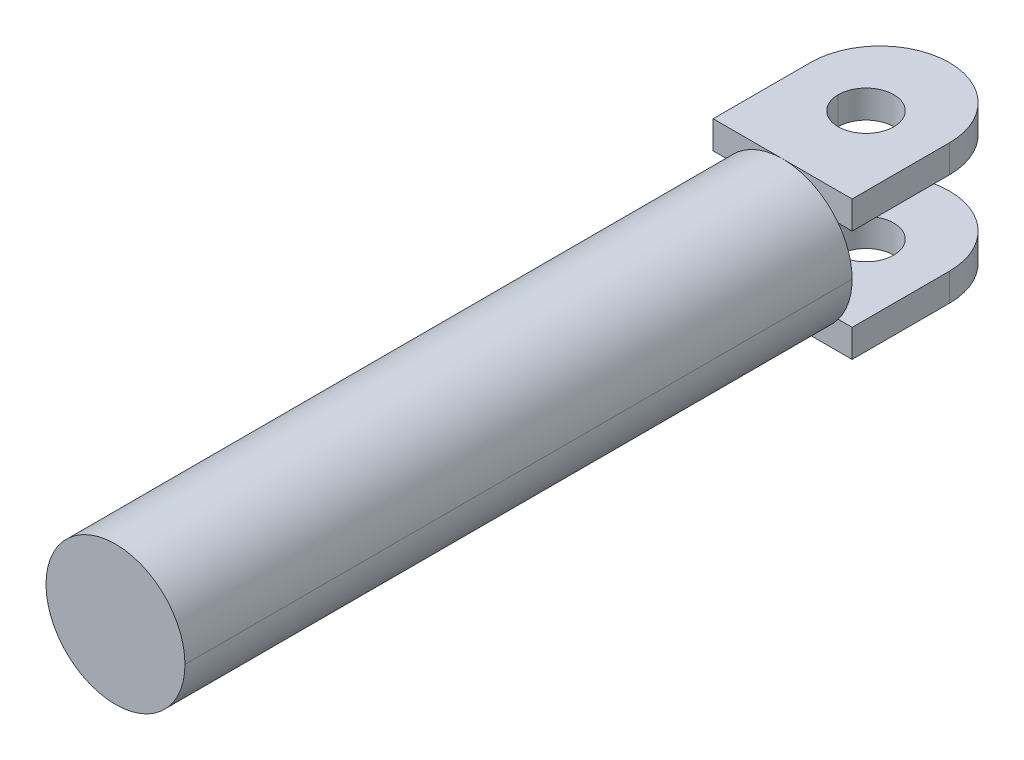
ISO-10303-21;
HEADER;
FILE_DESCRIPTION(('STEP AP214'),'2;1');
FILE_NAME('part.step','',(''),(''),'','','');
FILE_SCHEMA(('AUTOMOTIVE_DESIGN { 1 0 10303 214 1 1 1 1 }'));
ENDSEC;
DATA;
#1=APPLICATION_CONTEXT('core data for automotive mechanical design processes');
#2=APPLICATION_PROTOCOL_DEFINITION('international standard','automotive_design',2000,#1);
#3=PRODUCT_CONTEXT('',#1,'mechanical');
#4=PRODUCT('Part','Part','',(#3));
#5=PRODUCT_RELATED_PRODUCT_CATEGORY('part','',(#4));
#6=PRODUCT_DEFINITION_FORMATION('','',#4);
#7=PRODUCT_DEFINITION_CONTEXT('part definition',#1,'design');
#8=PRODUCT_DEFINITION('design','',#6,#7);
#9=PRODUCT_DEFINITION_SHAPE('','',#8);
#10=(LENGTH_UNIT() NAMED_UNIT(*) SI_UNIT(.MILLI.,.METRE.));
#11=(NAMED_UNIT(*) PLANE_ANGLE_UNIT() SI_UNIT($,.RADIAN.));
#12=(NAMED_UNIT(*) SI_UNIT($,.STERADIAN.) SOLID_ANGLE_UNIT());
#13=UNCERTAINTY_MEASURE_WITH_UNIT(LENGTH_MEASURE(1.E-05),#10,'distance_accuracy_value','');
#14=(GEOMETRIC_REPRESENTATION_CONTEXT(3) GLOBAL_UNCERTAINTY_ASSIGNED_CONTEXT((#13)) GLOBAL_UNIT_ASSIGNED_CONTEXT((#10,
#11,#12)) REPRESENTATION_CONTEXT('',''));
#15=CARTESIAN_POINT('',(0.,0.,0.));
#16=DIRECTION('',(0.,0.,1.));
#17=DIRECTION('',(1.,0.,0.));
#18=AXIS2_PLACEMENT_3D('',#15,#16,#17);
#19=CARTESIAN_POINT('',(0.,25.,-270.));
#20=DIRECTION('',(0.,1.,0.));
#21=DIRECTION('',(1.,0.,0.));
#22=AXIS2_PLACEMENT_3D('',#19,#20,#21);
#23=CYLINDRICAL_SURFACE('',#22,10.);
#24=DIRECTION('',(0.,1.,0.));
#25=VECTOR('',#24,1.);
#26=CARTESIAN_POINT('',(10.,-25.,-270.));
#27=LINE('',#26,#25);
#28=CARTESIAN_POINT('',(10.,-25.,-270.));
#29=VERTEX_POINT('',#28);
#30=CARTESIAN_POINT('',(10.,-15.,-270.));
#31=VERTEX_POINT('',#30);
#32=EDGE_CURVE('E24',#29,#31,#27,.T.);
#33=ORIENTED_EDGE('',*,*,#32,.F.);
#34=CARTESIAN_POINT('',(0.,-25.,-270.));
#35=DIRECTION('',(0.,1.,0.));
#36=DIRECTION('',(-1.,0.,0.));
#37=AXIS2_PLACEMENT_3D('',#34,#35,#36);
#38=CIRCLE('',#37,10.);
#39=CARTESIAN_POINT('',(-10.,-25.,-270.));
#40=VERTEX_POINT('',#39);
#41=EDGE_CURVE('E269',#40,#29,#38,.T.);
#42=ORIENTED_EDGE('',*,*,#41,.F.);
#43=DIRECTION('',(0.,1.,0.));
#44=VECTOR('',#43,1.);
#45=CARTESIAN_POINT('',(-10.,-25.,-270.));
#46=LINE('',#45,#44);
#47=CARTESIAN_POINT('',(-10.,-15.,-270.));
#48=VERTEX_POINT('',#47);
#49=EDGE_CURVE('E11',#40,#48,#46,.T.);
#50=ORIENTED_EDGE('',*,*,#49,.T.);
#51=CARTESIAN_POINT('',(0.,-15.,-270.));
#52=DIRECTION('',(0.,1.,0.));
#53=DIRECTION('',(-1.,0.,0.));
#54=AXIS2_PLACEMENT_3D('',#51,#52,#53);
#55=CIRCLE('',#54,10.);
#56=EDGE_CURVE('E242',#48,#31,#55,.T.);
#57=ORIENTED_EDGE('',*,*,#56,.T.);
#58=EDGE_LOOP('',(#33,#42,#50,#57));
#59=FACE_BOUND('',#58,.T.);
#60=ADVANCED_FACE('F17',(#59),#23,.F.);
#61=CARTESIAN_POINT('',(0.,25.,-270.));
#62=DIRECTION('',(0.,1.,0.));
#63=DIRECTION('',(1.,0.,0.));
#64=AXIS2_PLACEMENT_3D('',#61,#62,#63);
#65=CYLINDRICAL_SURFACE('',#64,10.);
#66=ORIENTED_EDGE('',*,*,#49,.F.);
#67=CARTESIAN_POINT('',(0.,-25.,-270.));
#68=DIRECTION('',(0.,1.,0.));
#69=DIRECTION('',(1.,0.,0.));
#70=AXIS2_PLACEMENT_3D('',#67,#68,#69);
#71=CIRCLE('',#70,10.);
#72=EDGE_CURVE('E266',#29,#40,#71,.T.);
#73=ORIENTED_EDGE('',*,*,#72,.F.);
#74=ORIENTED_EDGE('',*,*,#32,.T.);
#75=CARTESIAN_POINT('',(0.,-15.,-270.));
#76=DIRECTION('',(0.,1.,0.));
#77=DIRECTION('',(1.,0.,0.));
#78=AXIS2_PLACEMENT_3D('',#75,#76,#77);
#79=CIRCLE('',#78,10.);
#80=EDGE_CURVE('E246',#31,#48,#79,.T.);
#81=ORIENTED_EDGE('',*,*,#80,.T.);
#82=EDGE_LOOP('',(#66,#73,#74,#81));
#83=FACE_BOUND('',#82,.T.);
#84=ADVANCED_FACE('F288',(#83),#65,.F.);
#85=CARTESIAN_POINT('',(25.,-25.,-240.));
#86=DIRECTION('',(1.,0.,0.));
#87=DIRECTION('',(0.,0.,-1.));
#88=AXIS2_PLACEMENT_3D('',#85,#86,#87);
#89=PLANE('',#88);
#90=DIRECTION('',(0.,0.,-1.));
#91=VECTOR('',#90,1.);
#92=CARTESIAN_POINT('',(25.,-15.,-240.));
#93=LINE('',#92,#91);
#94=CARTESIAN_POINT('',(25.,-15.,-240.));
#95=VERTEX_POINT('',#94);
#96=CARTESIAN_POINT('',(25.,-15.,-275.));
#97=VERTEX_POINT('',#96);
#98=EDGE_CURVE('E235',#95,#97,#93,.T.);
#99=ORIENTED_EDGE('',*,*,#98,.F.);
#100=DIRECTION('',(0.,1.,0.));
#101=VECTOR('',#100,1.);
#102=CARTESIAN_POINT('',(25.,-25.,-240.));
#103=LINE('',#102,#101);
#104=CARTESIAN_POINT('',(25.,-25.,-240.));
#105=VERTEX_POINT('',#104);
#106=EDGE_CURVE('E231',#105,#95,#103,.T.);
#107=ORIENTED_EDGE('',*,*,#106,.F.);
#108=DIRECTION('',(0.,0.,-1.));
#109=VECTOR('',#108,1.);
#110=CARTESIAN_POINT('',(25.,-25.,-240.));
#111=LINE('',#110,#109);
#112=CARTESIAN_POINT('',(25.,-25.,-275.));
#113=VERTEX_POINT('',#112);
#114=EDGE_CURVE('E262',#105,#113,#111,.T.);
#115=ORIENTED_EDGE('',*,*,#114,.T.);
#116=DIRECTION('',(0.,-1.,0.));
#117=VECTOR('',#116,1.);
#118=CARTESIAN_POINT('',(25.,-15.,-275.));
#119=LINE('',#118,#117);
#120=EDGE_CURVE('E254',#97,#113,#119,.T.);
#121=ORIENTED_EDGE('',*,*,#120,.F.);
#122=EDGE_LOOP('',(#99,#107,#115,#121));
#123=FACE_BOUND('',#122,.T.);
#124=ADVANCED_FACE('F316',(#123),#89,.T.);
#125=CARTESIAN_POINT('',(0.,-25.,0.));
#126=DIRECTION('',(0.,1.,0.));
#127=DIRECTION('',(1.,0.,0.));
#128=AXIS2_PLACEMENT_3D('',#125,#126,#127);
#129=PLANE('',#128);
#130=ORIENTED_EDGE('',*,*,#41,.T.);
#131=ORIENTED_EDGE('',*,*,#72,.T.);
#132=EDGE_LOOP('',(#130,#131));
#133=FACE_BOUND('',#132,.T.);
#134=ORIENTED_EDGE('',*,*,#114,.F.);
#135=DIRECTION('',(1.,0.,0.));
#136=VECTOR('',#135,1.);
#137=CARTESIAN_POINT('',(0.,-25.,-240.));
#138=LINE('',#137,#136);
#139=CARTESIAN_POINT('',(0.,-25.,-240.));
#140=VERTEX_POINT('',#139);
#141=EDGE_CURVE('E236',#140,#105,#138,.T.);
#142=ORIENTED_EDGE('',*,*,#141,.F.);
#143=DIRECTION('',(1.,0.,0.));
#144=VECTOR('',#143,1.);
#145=CARTESIAN_POINT('',(-25.,-25.,-240.));
#146=LINE('',#145,#144);
#147=CARTESIAN_POINT('',(-25.,-25.,-240.));
#148=VERTEX_POINT('',#147);
#149=EDGE_CURVE('E259',#148,#140,#146,.T.);
#150=ORIENTED_EDGE('',*,*,#149,.F.);
#151=DIRECTION('',(0.,0.,1.));
#152=VECTOR('',#151,1.);
#153=CARTESIAN_POINT('',(-25.,-25.,-275.));
#154=LINE('',#153,#152);
#155=CARTESIAN_POINT('',(-25.,-25.,-275.));
#156=VERTEX_POINT('',#155);
#157=EDGE_CURVE('E253',#156,#148,#154,.T.);
#158=ORIENTED_EDGE('',*,*,#157,.F.);
#159=CARTESIAN_POINT('',(0.,-25.,-275.));
#160=DIRECTION('',(0.,1.,0.));
#161=DIRECTION('',(1.,0.,0.));
#162=AXIS2_PLACEMENT_3D('',#159,#160,#161);
#163=CIRCLE('',#162,25.);
#164=EDGE_CURVE('E241',#113,#156,#163,.T.);
#165=ORIENTED_EDGE('',*,*,#164,.F.);
#166=EDGE_LOOP('',(#134,#142,#150,#158,#165));
#167=FACE_BOUND('',#166,.T.);
#168=ADVANCED_FACE('F304',(#133,#167),#129,.F.);
#169=CARTESIAN_POINT('',(-25.,-25.,-240.));
#170=DIRECTION('',(0.,0.,1.));
#171=DIRECTION('',(1.,0.,0.));
#172=AXIS2_PLACEMENT_3D('',#169,#170,#171);
#173=PLANE('',#172);
#174=DIRECTION('',(0.,1.,0.));
#175=VECTOR('',#174,1.);
#176=CARTESIAN_POINT('',(-25.,-25.,-240.));
#177=LINE('',#176,#175);
#178=CARTESIAN_POINT('',(-25.,-15.,-240.));
#179=VERTEX_POINT('',#178);
#180=EDGE_CURVE('E250',#148,#179,#177,.T.);
#181=ORIENTED_EDGE('',*,*,#180,.F.);
#182=ORIENTED_EDGE('',*,*,#149,.T.);
#183=CARTESIAN_POINT('',(0.,0.,-240.));
#184=DIRECTION('',(0.,0.,1.));
#185=DIRECTION('',(-0.8,-0.6,0.));
#186=AXIS2_PLACEMENT_3D('',#183,#184,#185);
#187=CIRCLE('',#186,25.);
#188=CARTESIAN_POINT('',(-20.,-15.,-240.));
#189=VERTEX_POINT('',#188);
#190=EDGE_CURVE('E226',#189,#140,#187,.T.);
#191=ORIENTED_EDGE('',*,*,#190,.F.);
#192=DIRECTION('',(1.,0.,0.));
#193=VECTOR('',#192,1.);
#194=CARTESIAN_POINT('',(-25.,-15.,-240.));
#195=LINE('',#194,#193);
#196=EDGE_CURVE('E247',#179,#189,#195,.T.);
#197=ORIENTED_EDGE('',*,*,#196,.F.);
#198=EDGE_LOOP('',(#181,#182,#191,#197));
#199=FACE_BOUND('',#198,.T.);
#200=ADVANCED_FACE('F307',(#199),#173,.T.);
#201=CARTESIAN_POINT('',(-25.,-25.,-300.));
#202=DIRECTION('',(-1.,0.,0.));
#203=DIRECTION('',(0.,0.,1.));
#204=AXIS2_PLACEMENT_3D('',#201,#202,#203);
#205=PLANE('',#204);
#206=ORIENTED_EDGE('',*,*,#157,.T.);
#207=ORIENTED_EDGE('',*,*,#180,.T.);
#208=DIRECTION('',(0.,0.,1.));
#209=VECTOR('',#208,1.);
#210=CARTESIAN_POINT('',(-25.,-15.,-275.));
#211=LINE('',#210,#209);
#212=CARTESIAN_POINT('',(-25.,-15.,-275.));
#213=VERTEX_POINT('',#212);
#214=EDGE_CURVE('E243',#213,#179,#211,.T.);
#215=ORIENTED_EDGE('',*,*,#214,.F.);
#216=DIRECTION('',(0.,1.,0.));
#217=VECTOR('',#216,1.);
#218=CARTESIAN_POINT('',(-25.,-25.,-275.));
#219=LINE('',#218,#217);
#220=EDGE_CURVE('E238',#156,#213,#219,.T.);
#221=ORIENTED_EDGE('',*,*,#220,.F.);
#222=EDGE_LOOP('',(#206,#207,#215,#221));
#223=FACE_BOUND('',#222,.T.);
#224=ADVANCED_FACE('F298',(#223),#205,.T.);
#225=CARTESIAN_POINT('',(0.,90.2542748175507,-275.));
#226=DIRECTION('',(0.,-1.,0.));
#227=DIRECTION('',(0.,0.,-1.));
#228=AXIS2_PLACEMENT_3D('',#225,#226,#227);
#229=CYLINDRICAL_SURFACE('',#228,25.);
#230=ORIENTED_EDGE('',*,*,#120,.T.);
#231=ORIENTED_EDGE('',*,*,#164,.T.);
#232=ORIENTED_EDGE('',*,*,#220,.T.);
#233=CARTESIAN_POINT('',(0.,-15.,-275.));
#234=DIRECTION('',(0.,-1.,0.));
#235=DIRECTION('',(-1.,0.,0.));
#236=AXIS2_PLACEMENT_3D('',#233,#234,#235);
#237=CIRCLE('',#236,25.);
#238=EDGE_CURVE('E232',#213,#97,#237,.T.);
#239=ORIENTED_EDGE('',*,*,#238,.T.);
#240=EDGE_LOOP('',(#230,#231,#232,#239));
#241=FACE_BOUND('',#240,.T.);
#242=ADVANCED_FACE('F293',(#241),#229,.T.);
#243=CARTESIAN_POINT('',(0.,-15.,0.));
#244=DIRECTION('',(0.,1.,0.));
#245=DIRECTION('',(1.,0.,0.));
#246=AXIS2_PLACEMENT_3D('',#243,#244,#245);
#247=PLANE('',#246);
#248=ORIENTED_EDGE('',*,*,#56,.F.);
#249=ORIENTED_EDGE('',*,*,#80,.F.);
#250=EDGE_LOOP('',(#248,#249));
#251=FACE_BOUND('',#250,.T.);
#252=ORIENTED_EDGE('',*,*,#214,.T.);
#253=ORIENTED_EDGE('',*,*,#196,.T.);
#254=DIRECTION('',(1.,0.,0.));
#255=VECTOR('',#254,1.);
#256=CARTESIAN_POINT('',(-20.,-15.,-240.));
#257=LINE('',#256,#255);
#258=CARTESIAN_POINT('',(20.,-15.,-240.));
#259=VERTEX_POINT('',#258);
#260=EDGE_CURVE('E222',#189,#259,#257,.T.);
#261=ORIENTED_EDGE('',*,*,#260,.T.);
#262=DIRECTION('',(1.,0.,0.));
#263=VECTOR('',#262,1.);
#264=CARTESIAN_POINT('',(20.,-15.,-240.));
#265=LINE('',#264,#263);
#266=EDGE_CURVE('E228',#259,#95,#265,.T.);
#267=ORIENTED_EDGE('',*,*,#266,.T.);
#268=ORIENTED_EDGE('',*,*,#98,.T.);
#269=ORIENTED_EDGE('',*,*,#238,.F.);
#270=EDGE_LOOP('',(#252,#253,#261,#267,#268,#269));
#271=FACE_BOUND('',#270,.T.);
#272=ADVANCED_FACE('F289',(#251,#271),#247,.T.);
#273=CARTESIAN_POINT('',(-25.,-25.,-240.));
#274=DIRECTION('',(0.,0.,1.));
#275=DIRECTION('',(1.,0.,0.));
#276=AXIS2_PLACEMENT_3D('',#273,#274,#275);
#277=PLANE('',#276);
#278=CARTESIAN_POINT('',(0.,0.,-240.));
#279=DIRECTION('',(0.,0.,1.));
#280=DIRECTION('',(0.,-1.,0.));
#281=AXIS2_PLACEMENT_3D('',#278,#279,#280);
#282=CIRCLE('',#281,25.);
#283=EDGE_CURVE('E216',#140,#259,#282,.T.);
#284=ORIENTED_EDGE('',*,*,#283,.F.);
#285=ORIENTED_EDGE('',*,*,#141,.T.);
#286=ORIENTED_EDGE('',*,*,#106,.T.);
#287=ORIENTED_EDGE('',*,*,#266,.F.);
#288=EDGE_LOOP('',(#284,#285,#286,#287));
#289=FACE_BOUND('',#288,.T.);
#290=ADVANCED_FACE('F292',(#289),#277,.T.);
#291=CARTESIAN_POINT('',(0.,0.,0.));
#292=DIRECTION('',(0.,0.,1.));
#293=DIRECTION('',(1.,0.,0.));
#294=AXIS2_PLACEMENT_3D('',#291,#292,#293);
#295=CYLINDRICAL_SURFACE('',#294,25.);
#296=ORIENTED_EDGE('',*,*,#190,.T.);
#297=ORIENTED_EDGE('',*,*,#283,.T.);
#298=CARTESIAN_POINT('',(0.,0.,-240.));
#299=DIRECTION('',(0.,0.,1.));
#300=DIRECTION('',(0.8,-0.6,0.));
#301=AXIS2_PLACEMENT_3D('',#298,#299,#300);
#302=CIRCLE('',#301,25.);
#303=CARTESIAN_POINT('',(25.,0.,-240.));
#304=VERTEX_POINT('',#303);
#305=EDGE_CURVE('E142',#259,#304,#302,.T.);
#306=ORIENTED_EDGE('',*,*,#305,.T.);
#307=DIRECTION('',(0.,0.,-1.));
#308=VECTOR('',#307,1.);
#309=CARTESIAN_POINT('',(25.,0.,0.));
#310=LINE('',#309,#308);
#311=CARTESIAN_POINT('',(25.,0.,0.));
#312=VERTEX_POINT('',#311);
#313=EDGE_CURVE('E133',#312,#304,#310,.T.);
#314=ORIENTED_EDGE('',*,*,#313,.F.);
#315=CARTESIAN_POINT('',(0.,0.,0.));
#316=DIRECTION('',(0.,0.,1.));
#317=DIRECTION('',(-1.,0.,0.));
#318=AXIS2_PLACEMENT_3D('',#315,#316,#317);
#319=CIRCLE('',#318,25.);
#320=CARTESIAN_POINT('',(-25.,0.,0.));
#321=VERTEX_POINT('',#320);
#322=EDGE_CURVE('E138',#321,#312,#319,.T.);
#323=ORIENTED_EDGE('',*,*,#322,.F.);
#324=DIRECTION('',(0.,0.,-1.));
#325=VECTOR('',#324,1.);
#326=CARTESIAN_POINT('',(-25.,0.,0.));
#327=LINE('',#326,#325);
#328=CARTESIAN_POINT('',(-25.,0.,-240.));
#329=VERTEX_POINT('',#328);
#330=EDGE_CURVE('E146',#321,#329,#327,.T.);
#331=ORIENTED_EDGE('',*,*,#330,.T.);
#332=CARTESIAN_POINT('',(0.,0.,-240.));
#333=DIRECTION('',(0.,0.,1.));
#334=DIRECTION('',(-1.,0.,0.));
#335=AXIS2_PLACEMENT_3D('',#332,#333,#334);
#336=CIRCLE('',#335,25.);
#337=EDGE_CURVE('E174',#329,#189,#336,.T.);
#338=ORIENTED_EDGE('',*,*,#337,.T.);
#339=EDGE_LOOP('',(#296,#297,#306,#314,#323,#331,#338));
#340=FACE_BOUND('',#339,.T.);
#341=ADVANCED_FACE('F136',(#340),#295,.T.);
#342=CARTESIAN_POINT('',(0.,25.,-270.));
#343=DIRECTION('',(0.,1.,0.));
#344=DIRECTION('',(1.,0.,0.));
#345=AXIS2_PLACEMENT_3D('',#342,#343,#344);
#346=CYLINDRICAL_SURFACE('',#345,10.);
#347=DIRECTION('',(0.,1.,0.));
#348=VECTOR('',#347,1.);
#349=CARTESIAN_POINT('',(-10.,15.,-270.));
#350=LINE('',#349,#348);
#351=CARTESIAN_POINT('',(-10.,15.,-270.));
#352=VERTEX_POINT('',#351);
#353=CARTESIAN_POINT('',(-10.,25.,-270.));
#354=VERTEX_POINT('',#353);
#355=EDGE_CURVE('E207',#352,#354,#350,.T.);
#356=ORIENTED_EDGE('',*,*,#355,.T.);
#357=CARTESIAN_POINT('',(0.,25.,-270.));
#358=DIRECTION('',(0.,1.,0.));
#359=DIRECTION('',(-1.,0.,0.));
#360=AXIS2_PLACEMENT_3D('',#357,#358,#359);
#361=CIRCLE('',#360,10.);
#362=CARTESIAN_POINT('',(10.,25.,-270.));
#363=VERTEX_POINT('',#362);
#364=EDGE_CURVE('E202',#354,#363,#361,.T.);
#365=ORIENTED_EDGE('',*,*,#364,.T.);
#366=DIRECTION('',(0.,1.,0.));
#367=VECTOR('',#366,1.);
#368=CARTESIAN_POINT('',(10.,15.,-270.));
#369=LINE('',#368,#367);
#370=CARTESIAN_POINT('',(10.,15.,-270.));
#371=VERTEX_POINT('',#370);
#372=EDGE_CURVE('E213',#371,#363,#369,.T.);
#373=ORIENTED_EDGE('',*,*,#372,.F.);
#374=CARTESIAN_POINT('',(0.,15.,-270.));
#375=DIRECTION('',(0.,1.,0.));
#376=DIRECTION('',(-1.,0.,0.));
#377=AXIS2_PLACEMENT_3D('',#374,#375,#376);
#378=CIRCLE('',#377,10.);
#379=EDGE_CURVE('E179',#352,#371,#378,.T.);
#380=ORIENTED_EDGE('',*,*,#379,.F.);
#381=EDGE_LOOP('',(#356,#365,#373,#380));
#382=FACE_BOUND('',#381,.T.);
#383=ADVANCED_FACE('F395',(#382),#346,.F.);
#384=CARTESIAN_POINT('',(0.,25.,-270.));
#385=DIRECTION('',(0.,1.,0.));
#386=DIRECTION('',(1.,0.,0.));
#387=AXIS2_PLACEMENT_3D('',#384,#385,#386);
#388=CYLINDRICAL_SURFACE('',#387,10.);
#389=ORIENTED_EDGE('',*,*,#372,.T.);
#390=CARTESIAN_POINT('',(0.,25.,-270.));
#391=DIRECTION('',(0.,1.,0.));
#392=DIRECTION('',(1.,0.,0.));
#393=AXIS2_PLACEMENT_3D('',#390,#391,#392);
#394=CIRCLE('',#393,10.);
#395=EDGE_CURVE('E199',#363,#354,#394,.T.);
#396=ORIENTED_EDGE('',*,*,#395,.T.);
#397=ORIENTED_EDGE('',*,*,#355,.F.);
#398=CARTESIAN_POINT('',(0.,15.,-270.));
#399=DIRECTION('',(0.,1.,0.));
#400=DIRECTION('',(1.,0.,0.));
#401=AXIS2_PLACEMENT_3D('',#398,#399,#400);
#402=CIRCLE('',#401,10.);
#403=EDGE_CURVE('E182',#371,#352,#402,.T.);
#404=ORIENTED_EDGE('',*,*,#403,.F.);
#405=EDGE_LOOP('',(#389,#396,#397,#404));
#406=FACE_BOUND('',#405,.T.);
#407=ADVANCED_FACE('F404',(#406),#388,.F.);
#408=CARTESIAN_POINT('',(-25.,-25.,-300.));
#409=DIRECTION('',(-1.,0.,0.));
#410=DIRECTION('',(0.,0.,1.));
#411=AXIS2_PLACEMENT_3D('',#408,#409,#410);
#412=PLANE('',#411);
#413=DIRECTION('',(0.,0.,1.));
#414=VECTOR('',#413,1.);
#415=CARTESIAN_POINT('',(-25.,15.,-275.));
#416=LINE('',#415,#414);
#417=CARTESIAN_POINT('',(-25.,15.,-275.));
#418=VERTEX_POINT('',#417);
#419=CARTESIAN_POINT('',(-25.,15.,-240.));
#420=VERTEX_POINT('',#419);
#421=EDGE_CURVE('E171',#418,#420,#416,.T.);
#422=ORIENTED_EDGE('',*,*,#421,.T.);
#423=DIRECTION('',(0.,1.,0.));
#424=VECTOR('',#423,1.);
#425=CARTESIAN_POINT('',(-25.,15.,-240.));
#426=LINE('',#425,#424);
#427=CARTESIAN_POINT('',(-25.,25.,-240.));
#428=VERTEX_POINT('',#427);
#429=EDGE_CURVE('E204',#420,#428,#426,.T.);
#430=ORIENTED_EDGE('',*,*,#429,.T.);
#431=DIRECTION('',(0.,0.,1.));
#432=VECTOR('',#431,1.);
#433=CARTESIAN_POINT('',(-25.,25.,-275.));
#434=LINE('',#433,#432);
#435=CARTESIAN_POINT('',(-25.,25.,-275.));
#436=VERTEX_POINT('',#435);
#437=EDGE_CURVE('E31',#436,#428,#434,.T.);
#438=ORIENTED_EDGE('',*,*,#437,.F.);
#439=DIRECTION('',(0.,1.,0.));
#440=VECTOR('',#439,1.);
#441=CARTESIAN_POINT('',(-25.,15.,-275.));
#442=LINE('',#441,#440);
#443=EDGE_CURVE('E187',#418,#436,#442,.T.);
#444=ORIENTED_EDGE('',*,*,#443,.F.);
#445=EDGE_LOOP('',(#422,#430,#438,#444));
#446=FACE_BOUND('',#445,.T.);
#447=ADVANCED_FACE('F414',(#446),#412,.T.);
#448=CARTESIAN_POINT('',(-25.,-25.,-240.));
#449=DIRECTION('',(0.,0.,1.));
#450=DIRECTION('',(1.,0.,0.));
#451=AXIS2_PLACEMENT_3D('',#448,#449,#450);
#452=PLANE('',#451);
#453=CARTESIAN_POINT('',(0.,0.,-240.));
#454=DIRECTION('',(0.,0.,1.));
#455=DIRECTION('',(0.,1.,0.));
#456=AXIS2_PLACEMENT_3D('',#453,#454,#455);
#457=CIRCLE('',#456,25.);
#458=CARTESIAN_POINT('',(0.,25.,-240.));
#459=VERTEX_POINT('',#458);
#460=CARTESIAN_POINT('',(-20.,15.,-240.));
#461=VERTEX_POINT('',#460);
#462=EDGE_CURVE('E162',#459,#461,#457,.T.);
#463=ORIENTED_EDGE('',*,*,#462,.F.);
#464=DIRECTION('',(1.,0.,0.));
#465=VECTOR('',#464,1.);
#466=CARTESIAN_POINT('',(-25.,25.,-240.));
#467=LINE('',#466,#465);
#468=EDGE_CURVE('E195',#428,#459,#467,.T.);
#469=ORIENTED_EDGE('',*,*,#468,.F.);
#470=ORIENTED_EDGE('',*,*,#429,.F.);
#471=DIRECTION('',(1.,0.,0.));
#472=VECTOR('',#471,1.);
#473=CARTESIAN_POINT('',(-25.,15.,-240.));
#474=LINE('',#473,#472);
#475=EDGE_CURVE('E189',#420,#461,#474,.T.);
#476=ORIENTED_EDGE('',*,*,#475,.T.);
#477=EDGE_LOOP('',(#463,#469,#470,#476));
#478=FACE_BOUND('',#477,.T.);
#479=ADVANCED_FACE('F424',(#478),#452,.T.);
#480=CARTESIAN_POINT('',(0.,25.,0.));
#481=DIRECTION('',(0.,1.,0.));
#482=DIRECTION('',(1.,0.,0.));
#483=AXIS2_PLACEMENT_3D('',#480,#481,#482);
#484=PLANE('',#483);
#485=ORIENTED_EDGE('',*,*,#364,.F.);
#486=ORIENTED_EDGE('',*,*,#395,.F.);
#487=EDGE_LOOP('',(#485,#486));
#488=FACE_BOUND('',#487,.T.);
#489=ORIENTED_EDGE('',*,*,#437,.T.);
#490=ORIENTED_EDGE('',*,*,#468,.T.);
#491=DIRECTION('',(1.,0.,0.));
#492=VECTOR('',#491,1.);
#493=CARTESIAN_POINT('',(0.,25.,-240.));
#494=LINE('',#493,#492);
#495=CARTESIAN_POINT('',(25.,25.,-240.));
#496=VERTEX_POINT('',#495);
#497=EDGE_CURVE('E193',#459,#496,#494,.T.);
#498=ORIENTED_EDGE('',*,*,#497,.T.);
#499=DIRECTION('',(0.,0.,-1.));
#500=VECTOR('',#499,1.);
#501=CARTESIAN_POINT('',(25.,25.,-240.));
#502=LINE('',#501,#500);
#503=CARTESIAN_POINT('',(25.,25.,-275.));
#504=VERTEX_POINT('',#503);
#505=EDGE_CURVE('E38',#496,#504,#502,.T.);
#506=ORIENTED_EDGE('',*,*,#505,.T.);
#507=CARTESIAN_POINT('',(0.,25.,-275.));
#508=DIRECTION('',(0.,-1.,0.));
#509=DIRECTION('',(-1.,0.,0.));
#510=AXIS2_PLACEMENT_3D('',#507,#508,#509);
#511=CIRCLE('',#510,25.);
#512=EDGE_CURVE('E178',#436,#504,#511,.T.);
#513=ORIENTED_EDGE('',*,*,#512,.F.);
#514=EDGE_LOOP('',(#489,#490,#498,#506,#513));
#515=FACE_BOUND('',#514,.T.);
#516=ADVANCED_FACE('F433',(#488,#515),#484,.T.);
#517=CARTESIAN_POINT('',(-25.,-25.,-240.));
#518=DIRECTION('',(0.,0.,1.));
#519=DIRECTION('',(1.,0.,0.));
#520=AXIS2_PLACEMENT_3D('',#517,#518,#519);
#521=PLANE('',#520);
#522=DIRECTION('',(0.,1.,0.));
#523=VECTOR('',#522,1.);
#524=CARTESIAN_POINT('',(25.,15.,-240.));
#525=LINE('',#524,#523);
#526=CARTESIAN_POINT('',(25.,15.,-240.));
#527=VERTEX_POINT('',#526);
#528=EDGE_CURVE('E184',#527,#496,#525,.T.);
#529=ORIENTED_EDGE('',*,*,#528,.T.);
#530=ORIENTED_EDGE('',*,*,#497,.F.);
#531=CARTESIAN_POINT('',(0.,0.,-240.));
#532=DIRECTION('',(0.,0.,1.));
#533=DIRECTION('',(0.8,0.6,0.));
#534=AXIS2_PLACEMENT_3D('',#531,#532,#533);
#535=CIRCLE('',#534,25.);
#536=CARTESIAN_POINT('',(20.,15.,-240.));
#537=VERTEX_POINT('',#536);
#538=EDGE_CURVE('E165',#537,#459,#535,.T.);
#539=ORIENTED_EDGE('',*,*,#538,.F.);
#540=DIRECTION('',(1.,0.,0.));
#541=VECTOR('',#540,1.);
#542=CARTESIAN_POINT('',(20.,15.,-240.));
#543=LINE('',#542,#541);
#544=EDGE_CURVE('E183',#537,#527,#543,.T.);
#545=ORIENTED_EDGE('',*,*,#544,.T.);
#546=EDGE_LOOP('',(#529,#530,#539,#545));
#547=FACE_BOUND('',#546,.T.);
#548=ADVANCED_FACE('F443',(#547),#521,.T.);
#549=CARTESIAN_POINT('',(25.,-25.,-240.));
#550=DIRECTION('',(1.,0.,0.));
#551=DIRECTION('',(0.,0.,-1.));
#552=AXIS2_PLACEMENT_3D('',#549,#550,#551);
#553=PLANE('',#552);
#554=ORIENTED_EDGE('',*,*,#505,.F.);
#555=ORIENTED_EDGE('',*,*,#528,.F.);
#556=DIRECTION('',(0.,0.,-1.));
#557=VECTOR('',#556,1.);
#558=CARTESIAN_POINT('',(25.,15.,-240.));
#559=LINE('',#558,#557);
#560=CARTESIAN_POINT('',(25.,15.,-275.));
#561=VERTEX_POINT('',#560);
#562=EDGE_CURVE('E180',#527,#561,#559,.T.);
#563=ORIENTED_EDGE('',*,*,#562,.T.);
#564=DIRECTION('',(0.,-1.,0.));
#565=VECTOR('',#564,1.);
#566=CARTESIAN_POINT('',(25.,25.,-275.));
#567=LINE('',#566,#565);
#568=EDGE_CURVE('E175',#504,#561,#567,.T.);
#569=ORIENTED_EDGE('',*,*,#568,.F.);
#570=EDGE_LOOP('',(#554,#555,#563,#569));
#571=FACE_BOUND('',#570,.T.);
#572=ADVANCED_FACE('F453',(#571),#553,.T.);
#573=CARTESIAN_POINT('',(0.,-90.2542748175507,-275.));
#574=DIRECTION('',(0.,1.,0.));
#575=DIRECTION('',(0.,0.,-1.));
#576=AXIS2_PLACEMENT_3D('',#573,#574,#575);
#577=CYLINDRICAL_SURFACE('',#576,25.);
#578=ORIENTED_EDGE('',*,*,#443,.T.);
#579=ORIENTED_EDGE('',*,*,#512,.T.);
#580=ORIENTED_EDGE('',*,*,#568,.T.);
#581=CARTESIAN_POINT('',(0.,15.,-275.));
#582=DIRECTION('',(0.,1.,0.));
#583=DIRECTION('',(1.,0.,0.));
#584=AXIS2_PLACEMENT_3D('',#581,#582,#583);
#585=CIRCLE('',#584,25.);
#586=EDGE_CURVE('E168',#561,#418,#585,.T.);
#587=ORIENTED_EDGE('',*,*,#586,.T.);
#588=EDGE_LOOP('',(#578,#579,#580,#587));
#589=FACE_BOUND('',#588,.T.);
#590=ADVANCED_FACE('F463',(#589),#577,.T.);
#591=CARTESIAN_POINT('',(0.,15.,0.));
#592=DIRECTION('',(0.,1.,0.));
#593=DIRECTION('',(1.,0.,0.));
#594=AXIS2_PLACEMENT_3D('',#591,#592,#593);
#595=PLANE('',#594);
#596=ORIENTED_EDGE('',*,*,#379,.T.);
#597=ORIENTED_EDGE('',*,*,#403,.T.);
#598=EDGE_LOOP('',(#596,#597));
#599=FACE_BOUND('',#598,.T.);
#600=ORIENTED_EDGE('',*,*,#562,.F.);
#601=ORIENTED_EDGE('',*,*,#544,.F.);
#602=DIRECTION('',(1.,0.,0.));
#603=VECTOR('',#602,1.);
#604=CARTESIAN_POINT('',(-20.,15.,-240.));
#605=LINE('',#604,#603);
#606=EDGE_CURVE('E167',#461,#537,#605,.T.);
#607=ORIENTED_EDGE('',*,*,#606,.F.);
#608=ORIENTED_EDGE('',*,*,#475,.F.);
#609=ORIENTED_EDGE('',*,*,#421,.F.);
#610=ORIENTED_EDGE('',*,*,#586,.F.);
#611=EDGE_LOOP('',(#600,#601,#607,#608,#609,#610));
#612=FACE_BOUND('',#611,.T.);
#613=ADVANCED_FACE('F473',(#599,#612),#595,.F.);
#614=CARTESIAN_POINT('',(-25.,-15.,-240.));
#615=DIRECTION('',(0.,0.,1.));
#616=DIRECTION('',(1.,0.,0.));
#617=AXIS2_PLACEMENT_3D('',#614,#615,#616);
#618=PLANE('',#617);
#619=ORIENTED_EDGE('',*,*,#305,.F.);
#620=ORIENTED_EDGE('',*,*,#260,.F.);
#621=ORIENTED_EDGE('',*,*,#337,.F.);
#622=CARTESIAN_POINT('',(0.,0.,-240.));
#623=DIRECTION('',(0.,0.,1.));
#624=DIRECTION('',(-0.8,0.6,0.));
#625=AXIS2_PLACEMENT_3D('',#622,#623,#624);
#626=CIRCLE('',#625,25.);
#627=EDGE_CURVE('E160',#461,#329,#626,.T.);
#628=ORIENTED_EDGE('',*,*,#627,.F.);
#629=ORIENTED_EDGE('',*,*,#606,.T.);
#630=CARTESIAN_POINT('',(0.,0.,-240.));
#631=DIRECTION('',(0.,0.,1.));
#632=DIRECTION('',(1.,0.,0.));
#633=AXIS2_PLACEMENT_3D('',#630,#631,#632);
#634=CIRCLE('',#633,25.);
#635=EDGE_CURVE('E147',#304,#537,#634,.T.);
#636=ORIENTED_EDGE('',*,*,#635,.F.);
#637=EDGE_LOOP('',(#619,#620,#621,#628,#629,#636));
#638=FACE_BOUND('',#637,.T.);
#639=ADVANCED_FACE('F312',(#638),#618,.F.);
#640=CARTESIAN_POINT('',(0.,0.,0.));
#641=DIRECTION('',(0.,0.,1.));
#642=DIRECTION('',(1.,0.,0.));
#643=AXIS2_PLACEMENT_3D('',#640,#641,#642);
#644=CYLINDRICAL_SURFACE('',#643,25.);
#645=ORIENTED_EDGE('',*,*,#538,.T.);
#646=ORIENTED_EDGE('',*,*,#462,.T.);
#647=ORIENTED_EDGE('',*,*,#627,.T.);
#648=ORIENTED_EDGE('',*,*,#330,.F.);
#649=CARTESIAN_POINT('',(0.,0.,0.));
#650=DIRECTION('',(0.,0.,1.));
#651=DIRECTION('',(1.,0.,0.));
#652=AXIS2_PLACEMENT_3D('',#649,#650,#651);
#653=CIRCLE('',#652,25.);
#654=EDGE_CURVE('E150',#312,#321,#653,.T.);
#655=ORIENTED_EDGE('',*,*,#654,.F.);
#656=ORIENTED_EDGE('',*,*,#313,.T.);
#657=ORIENTED_EDGE('',*,*,#635,.T.);
#658=EDGE_LOOP('',(#645,#646,#647,#648,#655,#656,#657));
#659=FACE_BOUND('',#658,.T.);
#660=ADVANCED_FACE('F152',(#659),#644,.T.);
#661=CARTESIAN_POINT('',(0.,0.,0.));
#662=DIRECTION('',(0.,0.,1.));
#663=DIRECTION('',(1.,0.,0.));
#664=AXIS2_PLACEMENT_3D('',#661,#662,#663);
#665=PLANE('',#664);
#666=ORIENTED_EDGE('',*,*,#322,.T.);
#667=ORIENTED_EDGE('',*,*,#654,.T.);
#668=EDGE_LOOP('',(#666,#667));
#669=FACE_BOUND('',#668,.T.);
#670=ADVANCED_FACE('F156',(#669),#665,.T.);
#671=CLOSED_SHELL('',(#60,#84,#124,#168,#200,#224,#242,#272,#290,#341,#383,#407,#447,#479,#516,
#548,#572,#590,#613,#639,#660,#670));
#672=MANIFOLD_SOLID_BREP('B1',#671);
#673=ADVANCED_BREP_SHAPE_REPRESENTATION('',(#18,#672),#14);
#674=SHAPE_DEFINITION_REPRESENTATION(#9,#673);
ENDSEC;
END-ISO-10303-21;
